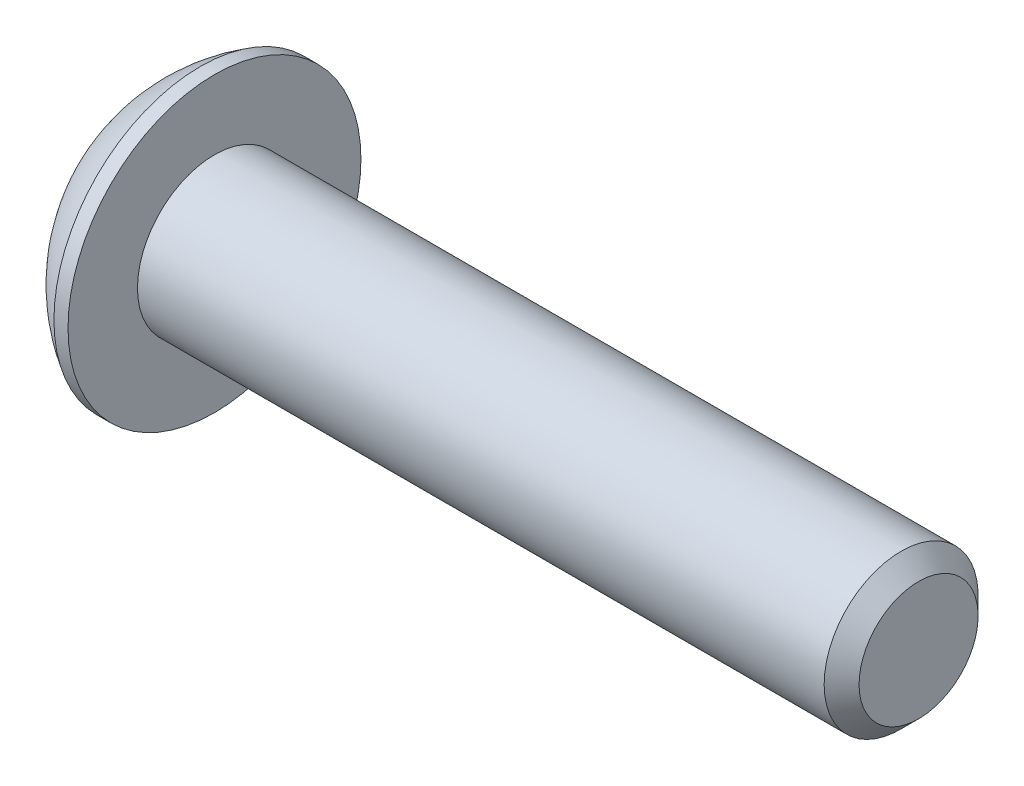
ISO-10303-21;
HEADER;
FILE_DESCRIPTION(('STEP AP214'),'2;1');
FILE_NAME('part.step','',(''),(''),'','','');
FILE_SCHEMA(('AUTOMOTIVE_DESIGN { 1 0 10303 214 1 1 1 1 }'));
ENDSEC;
DATA;
#1=APPLICATION_CONTEXT('core data for automotive mechanical design processes');
#2=APPLICATION_PROTOCOL_DEFINITION('international standard','automotive_design',2000,#1);
#3=PRODUCT_CONTEXT('',#1,'mechanical');
#4=PRODUCT('Part','Part','',(#3));
#5=PRODUCT_RELATED_PRODUCT_CATEGORY('part','',(#4));
#6=PRODUCT_DEFINITION_FORMATION('','',#4);
#7=PRODUCT_DEFINITION_CONTEXT('part definition',#1,'design');
#8=PRODUCT_DEFINITION('design','',#6,#7);
#9=PRODUCT_DEFINITION_SHAPE('','',#8);
#10=(LENGTH_UNIT() NAMED_UNIT(*) SI_UNIT(.MILLI.,.METRE.));
#11=(NAMED_UNIT(*) PLANE_ANGLE_UNIT() SI_UNIT($,.RADIAN.));
#12=(NAMED_UNIT(*) SI_UNIT($,.STERADIAN.) SOLID_ANGLE_UNIT());
#13=UNCERTAINTY_MEASURE_WITH_UNIT(LENGTH_MEASURE(1.E-05),#10,'distance_accuracy_value','');
#14=(GEOMETRIC_REPRESENTATION_CONTEXT(3) GLOBAL_UNCERTAINTY_ASSIGNED_CONTEXT((#13)) GLOBAL_UNIT_ASSIGNED_CONTEXT((#10,
#11,#12)) REPRESENTATION_CONTEXT('',''));
#15=CARTESIAN_POINT('',(0.,0.,0.));
#16=DIRECTION('',(0.,0.,1.));
#17=DIRECTION('',(1.,0.,0.));
#18=AXIS2_PLACEMENT_3D('',#15,#16,#17);
#19=CARTESIAN_POINT('',(1.32080000008727,0.,0.));
#20=DIRECTION('',(-1.,0.,0.));
#21=DIRECTION('',(0.,0.,1.));
#22=AXIS2_PLACEMENT_3D('',#19,#20,#21);
#23=CONICAL_SURFACE('',#22,1.19380000006686,1.04719755094562);
#24=CARTESIAN_POINT('',(2.01004075188393,0.,0.));
#25=VERTEX_POINT('',#24);
#26=VERTEX_LOOP('',#25);
#27=FACE_BOUND('',#26,.T.);
#28=CARTESIAN_POINT('',(1.32080000008727,0.,0.));
#29=DIRECTION('',(-1.,0.,0.));
#30=DIRECTION('',(0.,0.,1.));
#31=AXIS2_PLACEMENT_3D('',#28,#29,#30);
#32=CIRCLE('',#31,1.19380000006686);
#33=CARTESIAN_POINT('',(1.32080000005505,1.03386112706786,-0.596900000014786));
#34=VERTEX_POINT('',#33);
#35=CARTESIAN_POINT('',(1.32080000005175,1.49634720591905E-13,-1.19380000003343));
#36=VERTEX_POINT('',#35);
#37=EDGE_CURVE('E21',#34,#36,#32,.T.);
#38=ORIENTED_EDGE('',*,*,#37,.T.);
#39=CARTESIAN_POINT('',(1.32080000008727,0.,0.));
#40=DIRECTION('',(-1.,0.,0.));
#41=DIRECTION('',(0.,0.,1.));
#42=AXIS2_PLACEMENT_3D('',#39,#40,#41);
#43=CIRCLE('',#42,1.19380000006686);
#44=CARTESIAN_POINT('',(1.32080000005505,-1.03386112706567,-0.596900000018653));
#45=VERTEX_POINT('',#44);
#46=EDGE_CURVE('E145',#36,#45,#43,.T.);
#47=ORIENTED_EDGE('',*,*,#46,.T.);
#48=CARTESIAN_POINT('',(1.32080000008727,0.,0.));
#49=DIRECTION('',(-1.,0.,0.));
#50=DIRECTION('',(0.,0.,1.));
#51=AXIS2_PLACEMENT_3D('',#48,#49,#50);
#52=CIRCLE('',#51,1.19380000006686);
#53=CARTESIAN_POINT('',(1.32080000005505,-1.03386112706786,0.596900000014786));
#54=VERTEX_POINT('',#53);
#55=EDGE_CURVE('E147',#45,#54,#52,.T.);
#56=ORIENTED_EDGE('',*,*,#55,.T.);
#57=CARTESIAN_POINT('',(1.32080000008727,0.,0.));
#58=DIRECTION('',(-1.,0.,0.));
#59=DIRECTION('',(0.,0.,1.));
#60=AXIS2_PLACEMENT_3D('',#57,#58,#59);
#61=CIRCLE('',#60,1.19380000006686);
#62=CARTESIAN_POINT('',(1.32080000005175,0.,1.19380000003343));
#63=VERTEX_POINT('',#62);
#64=EDGE_CURVE('E149',#54,#63,#61,.T.);
#65=ORIENTED_EDGE('',*,*,#64,.T.);
#66=CARTESIAN_POINT('',(1.32080000008727,0.,0.));
#67=DIRECTION('',(-1.,0.,0.));
#68=DIRECTION('',(0.,0.,1.));
#69=AXIS2_PLACEMENT_3D('',#66,#67,#68);
#70=CIRCLE('',#69,1.19380000006686);
#71=CARTESIAN_POINT('',(1.32080000005505,1.03386112706567,0.596900000018653));
#72=VERTEX_POINT('',#71);
#73=EDGE_CURVE('E93',#63,#72,#70,.T.);
#74=ORIENTED_EDGE('',*,*,#73,.T.);
#75=CARTESIAN_POINT('',(1.32080000008727,0.,0.));
#76=DIRECTION('',(-1.,0.,0.));
#77=DIRECTION('',(0.,0.,1.));
#78=AXIS2_PLACEMENT_3D('',#75,#76,#77);
#79=CIRCLE('',#78,1.19380000006686);
#80=EDGE_CURVE('E89',#72,#34,#79,.T.);
#81=ORIENTED_EDGE('',*,*,#80,.T.);
#82=EDGE_LOOP('',(#38,#47,#56,#65,#74,#81));
#83=FACE_BOUND('',#82,.T.);
#84=ADVANCED_FACE('F17',(#27,#83),#23,.F.);
#85=CARTESIAN_POINT('',(1.3208,-2.0677222540758,-1.1938));
#86=DIRECTION('',(1.,0.,0.));
#87=DIRECTION('',(0.,0.,-1.));
#88=AXIS2_PLACEMENT_3D('',#85,#86,#87);
#89=PLANE('',#88);
#90=DIRECTION('',(0.,-0.500000000000017,-0.866025403784429));
#91=VECTOR('',#90,1.);
#92=CARTESIAN_POINT('',(1.3208,1.37848150271703,0.));
#93=LINE('',#92,#91);
#94=CARTESIAN_POINT('',(1.32080000000541,0.689240751358452,-1.19379999999997));
#95=VERTEX_POINT('',#94);
#96=EDGE_CURVE('E103',#95,#34,#93,.F.);
#97=ORIENTED_EDGE('',*,*,#96,.F.);
#98=DIRECTION('',(0.,1.,0.));
#99=VECTOR('',#98,1.);
#100=CARTESIAN_POINT('',(1.32080000001623,0.689240751358514,-1.1938));
#101=LINE('',#100,#99);
#102=EDGE_CURVE('E105',#36,#95,#101,.T.);
#103=ORIENTED_EDGE('',*,*,#102,.F.);
#104=ORIENTED_EDGE('',*,*,#37,.F.);
#105=EDGE_LOOP('',(#97,#103,#104));
#106=FACE_BOUND('',#105,.T.);
#107=ADVANCED_FACE('F101',(#106),#89,.F.);
#108=CARTESIAN_POINT('',(1.3208,-2.0677222540758,-1.1938));
#109=DIRECTION('',(1.,0.,0.));
#110=DIRECTION('',(0.,0.,-1.));
#111=AXIS2_PLACEMENT_3D('',#108,#109,#110);
#112=PLANE('',#111);
#113=DIRECTION('',(0.,0.500000000000017,-0.866025403784429));
#114=VECTOR('',#113,1.);
#115=CARTESIAN_POINT('',(1.3208,0.689240751358514,1.1938));
#116=LINE('',#115,#114);
#117=CARTESIAN_POINT('',(1.32080000000761,1.37848150271708,0.));
#118=VERTEX_POINT('',#117);
#119=EDGE_CURVE('E110',#118,#72,#116,.F.);
#120=ORIENTED_EDGE('',*,*,#119,.F.);
#121=DIRECTION('',(0.,-0.500000000000017,-0.866025403784429));
#122=VECTOR('',#121,1.);
#123=CARTESIAN_POINT('',(1.32080000002283,1.37848150271703,0.));
#124=LINE('',#123,#122);
#125=EDGE_CURVE('E107',#34,#118,#124,.F.);
#126=ORIENTED_EDGE('',*,*,#125,.F.);
#127=ORIENTED_EDGE('',*,*,#80,.F.);
#128=EDGE_LOOP('',(#120,#126,#127));
#129=FACE_BOUND('',#128,.T.);
#130=ADVANCED_FACE('F108',(#129),#112,.F.);
#131=CARTESIAN_POINT('',(1.3208,-2.0677222540758,-1.1938));
#132=DIRECTION('',(1.,0.,0.));
#133=DIRECTION('',(0.,0.,-1.));
#134=AXIS2_PLACEMENT_3D('',#131,#132,#133);
#135=PLANE('',#134);
#136=DIRECTION('',(0.,1.,0.));
#137=VECTOR('',#136,1.);
#138=CARTESIAN_POINT('',(1.3208,-0.689240751358514,1.1938));
#139=LINE('',#138,#137);
#140=CARTESIAN_POINT('',(1.32080000000761,0.689240751358514,1.1938));
#141=VERTEX_POINT('',#140);
#142=EDGE_CURVE('E161',#141,#63,#139,.F.);
#143=ORIENTED_EDGE('',*,*,#142,.F.);
#144=DIRECTION('',(0.,0.500000000000017,-0.866025403784429));
#145=VECTOR('',#144,1.);
#146=CARTESIAN_POINT('',(1.32080000002283,0.689240751358514,1.1938));
#147=LINE('',#146,#145);
#148=EDGE_CURVE('E163',#72,#141,#147,.F.);
#149=ORIENTED_EDGE('',*,*,#148,.F.);
#150=ORIENTED_EDGE('',*,*,#73,.F.);
#151=EDGE_LOOP('',(#143,#149,#150));
#152=FACE_BOUND('',#151,.T.);
#153=ADVANCED_FACE('F159',(#152),#135,.F.);
#154=CARTESIAN_POINT('',(1.3208,-2.0677222540758,-1.1938));
#155=DIRECTION('',(1.,0.,0.));
#156=DIRECTION('',(0.,0.,-1.));
#157=AXIS2_PLACEMENT_3D('',#154,#155,#156);
#158=PLANE('',#157);
#159=DIRECTION('',(0.,0.500000000000017,0.866025403784429));
#160=VECTOR('',#159,1.);
#161=CARTESIAN_POINT('',(1.3208,-1.37848150271703,0.));
#162=LINE('',#161,#160);
#163=CARTESIAN_POINT('',(1.32080000000541,-0.689240751358452,1.19379999999997));
#164=VERTEX_POINT('',#163);
#165=EDGE_CURVE('E167',#164,#54,#162,.F.);
#166=ORIENTED_EDGE('',*,*,#165,.F.);
#167=DIRECTION('',(0.,1.,0.));
#168=VECTOR('',#167,1.);
#169=CARTESIAN_POINT('',(1.32080000001623,-0.689240751358514,1.1938));
#170=LINE('',#169,#168);
#171=EDGE_CURVE('E164',#63,#164,#170,.F.);
#172=ORIENTED_EDGE('',*,*,#171,.F.);
#173=ORIENTED_EDGE('',*,*,#64,.F.);
#174=EDGE_LOOP('',(#166,#172,#173));
#175=FACE_BOUND('',#174,.T.);
#176=ADVANCED_FACE('F165',(#175),#158,.F.);
#177=CARTESIAN_POINT('',(1.3208,-2.0677222540758,-1.1938));
#178=DIRECTION('',(1.,0.,0.));
#179=DIRECTION('',(0.,0.,-1.));
#180=AXIS2_PLACEMENT_3D('',#177,#178,#179);
#181=PLANE('',#180);
#182=DIRECTION('',(0.,-0.500000000000017,0.866025403784429));
#183=VECTOR('',#182,1.);
#184=CARTESIAN_POINT('',(1.3208,-0.689240751358514,-1.1938));
#185=LINE('',#184,#183);
#186=CARTESIAN_POINT('',(1.32080000000761,-1.37848150271708,0.));
#187=VERTEX_POINT('',#186);
#188=EDGE_CURVE('E210',#187,#45,#185,.F.);
#189=ORIENTED_EDGE('',*,*,#188,.F.);
#190=DIRECTION('',(0.,0.500000000000017,0.866025403784429));
#191=VECTOR('',#190,1.);
#192=CARTESIAN_POINT('',(1.32080000002283,-1.37848150271703,0.));
#193=LINE('',#192,#191);
#194=EDGE_CURVE('E219',#54,#187,#193,.F.);
#195=ORIENTED_EDGE('',*,*,#194,.F.);
#196=ORIENTED_EDGE('',*,*,#55,.F.);
#197=EDGE_LOOP('',(#189,#195,#196));
#198=FACE_BOUND('',#197,.T.);
#199=ADVANCED_FACE('F246',(#198),#181,.F.);
#200=CARTESIAN_POINT('',(1.3208,-2.0677222540758,-1.1938));
#201=DIRECTION('',(1.,0.,0.));
#202=DIRECTION('',(0.,0.,-1.));
#203=AXIS2_PLACEMENT_3D('',#200,#201,#202);
#204=PLANE('',#203);
#205=DIRECTION('',(0.,1.,0.));
#206=VECTOR('',#205,1.);
#207=CARTESIAN_POINT('',(1.3208,0.689240751358514,-1.1938));
#208=LINE('',#207,#206);
#209=CARTESIAN_POINT('',(1.32080000001142,-0.689240751358514,-1.1938));
#210=VERTEX_POINT('',#209);
#211=EDGE_CURVE('E129',#210,#36,#208,.T.);
#212=ORIENTED_EDGE('',*,*,#211,.F.);
#213=DIRECTION('',(0.,-0.500000000000017,0.866025403784429));
#214=VECTOR('',#213,1.);
#215=CARTESIAN_POINT('',(1.32080000002283,-0.689240751358514,-1.1938));
#216=LINE('',#215,#214);
#217=EDGE_CURVE('E206',#45,#210,#216,.F.);
#218=ORIENTED_EDGE('',*,*,#217,.F.);
#219=ORIENTED_EDGE('',*,*,#46,.F.);
#220=EDGE_LOOP('',(#212,#218,#219));
#221=FACE_BOUND('',#220,.T.);
#222=ADVANCED_FACE('F242',(#221),#204,.F.);
#223=CARTESIAN_POINT('',(1.3208,0.689240751358514,-1.1938));
#224=DIRECTION('',(0.,0.,1.));
#225=DIRECTION('',(1.,0.,0.));
#226=AXIS2_PLACEMENT_3D('',#223,#224,#225);
#227=PLANE('',#226);
#228=ORIENTED_EDGE('',*,*,#211,.T.);
#229=ORIENTED_EDGE('',*,*,#102,.T.);
#230=DIRECTION('',(1.,0.,0.));
#231=VECTOR('',#230,1.);
#232=CARTESIAN_POINT('',(1.3208,0.689240751358445,-1.19379999999996));
#233=LINE('',#232,#231);
#234=CARTESIAN_POINT('',(0.,0.689240751358443,-1.19379999999998));
#235=VERTEX_POINT('',#234);
#236=EDGE_CURVE('E117',#235,#95,#233,.T.);
#237=ORIENTED_EDGE('',*,*,#236,.F.);
#238=DIRECTION('',(0.,1.,0.));
#239=VECTOR('',#238,1.);
#240=CARTESIAN_POINT('',(0.,0.,-1.1938));
#241=LINE('',#240,#239);
#242=CARTESIAN_POINT('',(0.,-0.689240751358514,-1.1938));
#243=VERTEX_POINT('',#242);
#244=EDGE_CURVE('E203',#243,#235,#241,.T.);
#245=ORIENTED_EDGE('',*,*,#244,.F.);
#246=DIRECTION('',(1.,0.,0.));
#247=VECTOR('',#246,1.);
#248=CARTESIAN_POINT('',(1.3208,-0.689240751358514,-1.1938));
#249=LINE('',#248,#247);
#250=EDGE_CURVE('E239',#210,#243,#249,.F.);
#251=ORIENTED_EDGE('',*,*,#250,.F.);
#252=EDGE_LOOP('',(#228,#229,#237,#245,#251));
#253=FACE_BOUND('',#252,.T.);
#254=ADVANCED_FACE('F237',(#253),#227,.T.);
#255=CARTESIAN_POINT('',(1.3208,1.37848150271703,0.));
#256=DIRECTION('',(0.,-0.866025403784429,0.500000000000017));
#257=DIRECTION('',(0.,-0.500000000000017,-0.866025403784429));
#258=AXIS2_PLACEMENT_3D('',#255,#256,#257);
#259=PLANE('',#258);
#260=ORIENTED_EDGE('',*,*,#96,.T.);
#261=ORIENTED_EDGE('',*,*,#125,.T.);
#262=DIRECTION('',(1.,0.,0.));
#263=VECTOR('',#262,1.);
#264=CARTESIAN_POINT('',(1.3208,1.3784815027171,0.));
#265=LINE('',#264,#263);
#266=CARTESIAN_POINT('',(0.,1.37848150271708,0.));
#267=VERTEX_POINT('',#266);
#268=EDGE_CURVE('E113',#267,#118,#265,.T.);
#269=ORIENTED_EDGE('',*,*,#268,.F.);
#270=DIRECTION('',(0.,0.500000000000029,0.866025403784422));
#271=VECTOR('',#270,1.);
#272=CARTESIAN_POINT('',(0.,0.689240751358445,-1.19379999999996));
#273=LINE('',#272,#271);
#274=EDGE_CURVE('E192',#235,#267,#273,.T.);
#275=ORIENTED_EDGE('',*,*,#274,.F.);
#276=ORIENTED_EDGE('',*,*,#236,.T.);
#277=EDGE_LOOP('',(#260,#261,#269,#275,#276));
#278=FACE_BOUND('',#277,.T.);
#279=ADVANCED_FACE('F115',(#278),#259,.T.);
#280=CARTESIAN_POINT('',(1.3208,0.689240751358514,1.1938));
#281=DIRECTION('',(0.,-0.866025403784429,-0.500000000000017));
#282=DIRECTION('',(0.,0.500000000000017,-0.866025403784429));
#283=AXIS2_PLACEMENT_3D('',#280,#281,#282);
#284=PLANE('',#283);
#285=ORIENTED_EDGE('',*,*,#119,.T.);
#286=ORIENTED_EDGE('',*,*,#148,.T.);
#287=DIRECTION('',(-1.,0.,0.));
#288=VECTOR('',#287,1.);
#289=CARTESIAN_POINT('',(1.3208,0.689240751358514,1.1938));
#290=LINE('',#289,#288);
#291=CARTESIAN_POINT('',(0.,0.689240751358514,1.1938));
#292=VERTEX_POINT('',#291);
#293=EDGE_CURVE('E174',#292,#141,#290,.F.);
#294=ORIENTED_EDGE('',*,*,#293,.F.);
#295=DIRECTION('',(0.,-0.499999999999992,0.866025403784443));
#296=VECTOR('',#295,1.);
#297=CARTESIAN_POINT('',(0.,1.37848150271706,0.));
#298=LINE('',#297,#296);
#299=EDGE_CURVE('E188',#267,#292,#298,.T.);
#300=ORIENTED_EDGE('',*,*,#299,.F.);
#301=ORIENTED_EDGE('',*,*,#268,.T.);
#302=EDGE_LOOP('',(#285,#286,#294,#300,#301));
#303=FACE_BOUND('',#302,.T.);
#304=ADVANCED_FACE('F252',(#303),#284,.T.);
#305=CARTESIAN_POINT('',(1.3208,-0.689240751358514,1.1938));
#306=DIRECTION('',(0.,0.,-1.));
#307=DIRECTION('',(-1.,0.,0.));
#308=AXIS2_PLACEMENT_3D('',#305,#306,#307);
#309=PLANE('',#308);
#310=ORIENTED_EDGE('',*,*,#142,.T.);
#311=ORIENTED_EDGE('',*,*,#171,.T.);
#312=DIRECTION('',(1.,0.,0.));
#313=VECTOR('',#312,1.);
#314=CARTESIAN_POINT('',(1.3208,-0.689240751358445,1.19379999999996));
#315=LINE('',#314,#313);
#316=CARTESIAN_POINT('',(0.,-0.689240751358458,1.19379999999998));
#317=VERTEX_POINT('',#316);
#318=EDGE_CURVE('E170',#317,#164,#315,.T.);
#319=ORIENTED_EDGE('',*,*,#318,.F.);
#320=DIRECTION('',(0.,1.,0.));
#321=VECTOR('',#320,1.);
#322=CARTESIAN_POINT('',(0.,0.,1.1938));
#323=LINE('',#322,#321);
#324=EDGE_CURVE('E191',#292,#317,#323,.F.);
#325=ORIENTED_EDGE('',*,*,#324,.F.);
#326=ORIENTED_EDGE('',*,*,#293,.T.);
#327=EDGE_LOOP('',(#310,#311,#319,#325,#326));
#328=FACE_BOUND('',#327,.T.);
#329=ADVANCED_FACE('F172',(#328),#309,.T.);
#330=CARTESIAN_POINT('',(1.3208,-1.37848150271703,0.));
#331=DIRECTION('',(0.,0.866025403784429,-0.500000000000017));
#332=DIRECTION('',(0.,0.500000000000017,0.866025403784429));
#333=AXIS2_PLACEMENT_3D('',#330,#331,#332);
#334=PLANE('',#333);
#335=ORIENTED_EDGE('',*,*,#165,.T.);
#336=ORIENTED_EDGE('',*,*,#194,.T.);
#337=DIRECTION('',(1.,0.,0.));
#338=VECTOR('',#337,1.);
#339=CARTESIAN_POINT('',(1.3208,-1.3784815027171,0.));
#340=LINE('',#339,#338);
#341=CARTESIAN_POINT('',(0.,-1.3784815027171,0.));
#342=VERTEX_POINT('',#341);
#343=EDGE_CURVE('E36',#342,#187,#340,.T.);
#344=ORIENTED_EDGE('',*,*,#343,.F.);
#345=DIRECTION('',(0.,-0.500000000000004,-0.866025403784436));
#346=VECTOR('',#345,1.);
#347=CARTESIAN_POINT('',(0.,-0.689240751358479,1.19379999999998));
#348=LINE('',#347,#346);
#349=EDGE_CURVE('E227',#317,#342,#348,.T.);
#350=ORIENTED_EDGE('',*,*,#349,.F.);
#351=ORIENTED_EDGE('',*,*,#318,.T.);
#352=EDGE_LOOP('',(#335,#336,#344,#350,#351));
#353=FACE_BOUND('',#352,.T.);
#354=ADVANCED_FACE('F248',(#353),#334,.T.);
#355=CARTESIAN_POINT('',(1.3208,-0.689240751358514,-1.1938));
#356=DIRECTION('',(0.,0.866025403784429,0.500000000000017));
#357=DIRECTION('',(0.,-0.500000000000017,0.866025403784429));
#358=AXIS2_PLACEMENT_3D('',#355,#356,#357);
#359=PLANE('',#358);
#360=ORIENTED_EDGE('',*,*,#188,.T.);
#361=ORIENTED_EDGE('',*,*,#217,.T.);
#362=ORIENTED_EDGE('',*,*,#250,.T.);
#363=DIRECTION('',(0.,0.499999999999992,-0.866025403784443));
#364=VECTOR('',#363,1.);
#365=CARTESIAN_POINT('',(0.,-1.37848150271706,0.));
#366=LINE('',#365,#364);
#367=EDGE_CURVE('E144',#342,#243,#366,.T.);
#368=ORIENTED_EDGE('',*,*,#367,.F.);
#369=ORIENTED_EDGE('',*,*,#343,.T.);
#370=EDGE_LOOP('',(#360,#361,#362,#368,#369));
#371=FACE_BOUND('',#370,.T.);
#372=ADVANCED_FACE('F288',(#371),#359,.T.);
#373=CARTESIAN_POINT('',(0.,0.,0.));
#374=DIRECTION('',(-1.,0.,0.));
#375=DIRECTION('',(0.,0.,1.));
#376=AXIS2_PLACEMENT_3D('',#373,#374,#375);
#377=PLANE('',#376);
#378=CARTESIAN_POINT('',(0.,0.,0.));
#379=DIRECTION('',(-1.,0.,0.));
#380=DIRECTION('',(0.,0.,1.));
#381=AXIS2_PLACEMENT_3D('',#378,#379,#380);
#382=CIRCLE('',#381,1.98120000000012);
#383=CARTESIAN_POINT('',(0.,0.,1.98120000000012));
#384=VERTEX_POINT('',#383);
#385=EDGE_CURVE('E141',#384,#384,#382,.F.);
#386=ORIENTED_EDGE('',*,*,#385,.F.);
#387=EDGE_LOOP('',(#386));
#388=FACE_BOUND('',#387,.T.);
#389=ORIENTED_EDGE('',*,*,#349,.T.);
#390=ORIENTED_EDGE('',*,*,#367,.T.);
#391=ORIENTED_EDGE('',*,*,#244,.T.);
#392=ORIENTED_EDGE('',*,*,#274,.T.);
#393=ORIENTED_EDGE('',*,*,#299,.T.);
#394=ORIENTED_EDGE('',*,*,#324,.T.);
#395=EDGE_LOOP('',(#389,#390,#391,#392,#393,#394));
#396=FACE_BOUND('',#395,.T.);
#397=ADVANCED_FACE('F250',(#388,#396),#377,.T.);
#398=CARTESIAN_POINT('',(4.13385,0.,0.));
#399=DIRECTION('',(-0.489667403954906,0.,-0.87190930348521));
#400=DIRECTION('',(-0.0817796561711017,-0.995591648055329,0.0459277493353499));
#401=AXIS2_PLACEMENT_3D('',#398,#399,#400);
#402=SPHERICAL_SURFACE('',#401,4.58408870578444);
#403=CARTESIAN_POINT('',(4.13385,0.,0.));
#404=DIRECTION('',(-1.,0.,0.));
#405=DIRECTION('',(0.,0.,1.));
#406=AXIS2_PLACEMENT_3D('',#403,#404,#405);
#407=SPHERICAL_SURFACE('',#406,4.58408870578444);
#408=CARTESIAN_POINT('',(1.8288,0.,0.));
#409=DIRECTION('',(-1.,0.,0.));
#410=DIRECTION('',(0.,0.,1.));
#411=AXIS2_PLACEMENT_3D('',#408,#409,#410);
#412=CIRCLE('',#411,3.9624);
#413=CARTESIAN_POINT('',(1.8288,0.,3.9624));
#414=VERTEX_POINT('',#413);
#415=EDGE_CURVE('E138',#414,#414,#412,.F.);
#416=ORIENTED_EDGE('',*,*,#415,.F.);
#417=EDGE_LOOP('',(#416));
#418=FACE_BOUND('',#417,.T.);
#419=ORIENTED_EDGE('',*,*,#385,.T.);
#420=EDGE_LOOP('',(#419));
#421=FACE_BOUND('',#420,.T.);
#422=ADVANCED_FACE('F19',(#418,#421),#407,.T.);
#423=CARTESIAN_POINT('',(21.2598,0.,0.));
#424=DIRECTION('',(-1.,0.,0.));
#425=DIRECTION('',(0.,0.,1.));
#426=AXIS2_PLACEMENT_3D('',#423,#424,#425);
#427=PLANE('',#426);
#428=CARTESIAN_POINT('',(21.2597999999957,0.,0.));
#429=DIRECTION('',(-1.,0.,0.));
#430=DIRECTION('',(0.,0.,1.));
#431=AXIS2_PLACEMENT_3D('',#428,#429,#430);
#432=CIRCLE('',#431,1.61035999997239);
#433=CARTESIAN_POINT('',(21.2597999999957,0.,1.61035999997239));
#434=VERTEX_POINT('',#433);
#435=EDGE_CURVE('E135',#434,#434,#432,.T.);
#436=ORIENTED_EDGE('',*,*,#435,.F.);
#437=EDGE_LOOP('',(#436));
#438=FACE_BOUND('',#437,.T.);
#439=ADVANCED_FACE('F281',(#438),#427,.F.);
#440=CARTESIAN_POINT('',(0.,0.,0.));
#441=DIRECTION('',(-1.,0.,0.));
#442=DIRECTION('',(0.,0.,1.));
#443=AXIS2_PLACEMENT_3D('',#440,#441,#442);
#444=CYLINDRICAL_SURFACE('',#443,3.9624);
#445=ORIENTED_EDGE('',*,*,#415,.T.);
#446=EDGE_LOOP('',(#445));
#447=FACE_BOUND('',#446,.T.);
#448=CARTESIAN_POINT('',(2.2098,0.,0.));
#449=DIRECTION('',(-1.,0.,0.));
#450=DIRECTION('',(0.,0.,1.));
#451=AXIS2_PLACEMENT_3D('',#448,#449,#450);
#452=CIRCLE('',#451,3.9624);
#453=CARTESIAN_POINT('',(2.2098,0.,3.9624));
#454=VERTEX_POINT('',#453);
#455=EDGE_CURVE('E132',#454,#454,#452,.T.);
#456=ORIENTED_EDGE('',*,*,#455,.T.);
#457=EDGE_LOOP('',(#456));
#458=FACE_BOUND('',#457,.T.);
#459=ADVANCED_FACE('F277',(#447,#458),#444,.T.);
#460=CARTESIAN_POINT('',(20.7873600000994,0.,0.));
#461=DIRECTION('',(-1.,0.,0.));
#462=DIRECTION('',(0.,0.,1.));
#463=AXIS2_PLACEMENT_3D('',#460,#461,#462);
#464=CONICAL_SURFACE('',#463,2.08279999986871,0.785398163397448);
#465=CARTESIAN_POINT('',(20.7873599999848,0.,0.));
#466=DIRECTION('',(-1.,0.,0.));
#467=DIRECTION('',(0.,0.,1.));
#468=AXIS2_PLACEMENT_3D('',#465,#466,#467);
#469=CIRCLE('',#468,2.0828);
#470=CARTESIAN_POINT('',(20.7873599999848,0.,2.0828));
#471=VERTEX_POINT('',#470);
#472=EDGE_CURVE('E27',#471,#471,#469,.T.);
#473=ORIENTED_EDGE('',*,*,#472,.F.);
#474=EDGE_LOOP('',(#473));
#475=FACE_BOUND('',#474,.T.);
#476=ORIENTED_EDGE('',*,*,#435,.T.);
#477=EDGE_LOOP('',(#476));
#478=FACE_BOUND('',#477,.T.);
#479=ADVANCED_FACE('F270',(#475,#478),#464,.T.);
#480=CARTESIAN_POINT('',(2.2098,2.0828,0.));
#481=DIRECTION('',(-1.,0.,0.));
#482=DIRECTION('',(0.,0.,1.));
#483=AXIS2_PLACEMENT_3D('',#480,#481,#482);
#484=PLANE('',#483);
#485=ORIENTED_EDGE('',*,*,#455,.F.);
#486=EDGE_LOOP('',(#485));
#487=FACE_BOUND('',#486,.T.);
#488=CARTESIAN_POINT('',(2.2098,0.,0.));
#489=DIRECTION('',(-1.,0.,0.));
#490=DIRECTION('',(0.,0.,1.));
#491=AXIS2_PLACEMENT_3D('',#488,#489,#490);
#492=CIRCLE('',#491,2.0828);
#493=CARTESIAN_POINT('',(2.2098,0.,2.0828));
#494=VERTEX_POINT('',#493);
#495=EDGE_CURVE('E11',#494,#494,#492,.F.);
#496=ORIENTED_EDGE('',*,*,#495,.F.);
#497=EDGE_LOOP('',(#496));
#498=FACE_BOUND('',#497,.T.);
#499=ADVANCED_FACE('F264',(#487,#498),#484,.F.);
#500=CARTESIAN_POINT('',(0.,0.,0.));
#501=DIRECTION('',(-1.,0.,0.));
#502=DIRECTION('',(0.,0.,1.));
#503=AXIS2_PLACEMENT_3D('',#500,#501,#502);
#504=CYLINDRICAL_SURFACE('',#503,2.0828);
#505=ORIENTED_EDGE('',*,*,#495,.T.);
#506=EDGE_LOOP('',(#505));
#507=FACE_BOUND('',#506,.T.);
#508=ORIENTED_EDGE('',*,*,#472,.T.);
#509=EDGE_LOOP('',(#508));
#510=FACE_BOUND('',#509,.T.);
#511=ADVANCED_FACE('F262',(#507,#510),#504,.T.);
#512=CLOSED_SHELL('',(#84,#107,#130,#153,#176,#199,#222,#254,#279,#304,#329,#354,#372,#397,#422,
#439,#459,#479,#499,#511));
#513=MANIFOLD_SOLID_BREP('B1',#512);
#514=ADVANCED_BREP_SHAPE_REPRESENTATION('',(#18,#513),#14);
#515=SHAPE_DEFINITION_REPRESENTATION(#9,#514);
ENDSEC;
END-ISO-10303-21;
